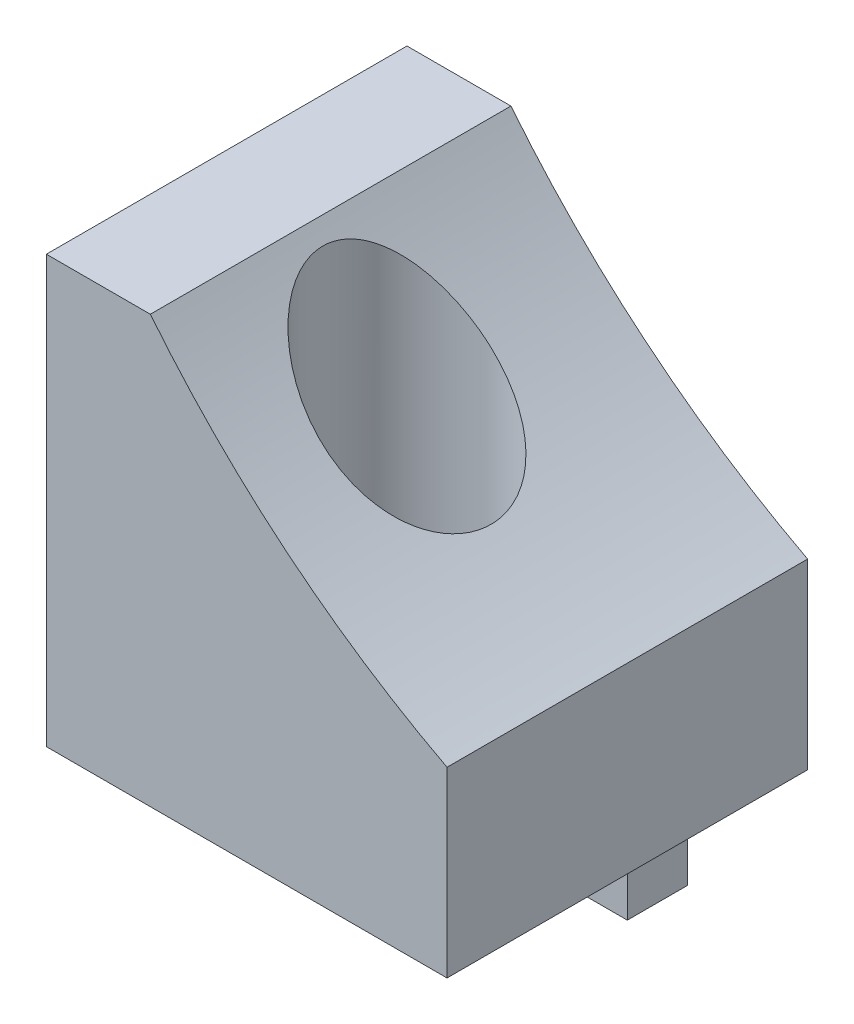
ISO-10303-21;
HEADER;
FILE_DESCRIPTION(('STEP AP214'),'2;1');
FILE_NAME('part.step','',(''),(''),'','','');
FILE_SCHEMA(('AUTOMOTIVE_DESIGN { 1 0 10303 214 1 1 1 1 }'));
ENDSEC;
DATA;
#1=APPLICATION_CONTEXT('core data for automotive mechanical design processes');
#2=APPLICATION_PROTOCOL_DEFINITION('international standard','automotive_design',2000,#1);
#3=PRODUCT_CONTEXT('',#1,'mechanical');
#4=PRODUCT('Part','Part','',(#3));
#5=PRODUCT_RELATED_PRODUCT_CATEGORY('part','',(#4));
#6=PRODUCT_DEFINITION_FORMATION('','',#4);
#7=PRODUCT_DEFINITION_CONTEXT('part definition',#1,'design');
#8=PRODUCT_DEFINITION('design','',#6,#7);
#9=PRODUCT_DEFINITION_SHAPE('','',#8);
#10=(LENGTH_UNIT() NAMED_UNIT(*) SI_UNIT(.MILLI.,.METRE.));
#11=(NAMED_UNIT(*) PLANE_ANGLE_UNIT() SI_UNIT($,.RADIAN.));
#12=(NAMED_UNIT(*) SI_UNIT($,.STERADIAN.) SOLID_ANGLE_UNIT());
#13=UNCERTAINTY_MEASURE_WITH_UNIT(LENGTH_MEASURE(1.E-05),#10,'distance_accuracy_value','');
#14=(GEOMETRIC_REPRESENTATION_CONTEXT(3) GLOBAL_UNCERTAINTY_ASSIGNED_CONTEXT((#13)) GLOBAL_UNIT_ASSIGNED_CONTEXT((#10,
#11,#12)) REPRESENTATION_CONTEXT('',''));
#15=CARTESIAN_POINT('',(0.,0.,0.));
#16=DIRECTION('',(0.,0.,1.));
#17=DIRECTION('',(1.,0.,0.));
#18=AXIS2_PLACEMENT_3D('',#15,#16,#17);
#19=CARTESIAN_POINT('',(0.,0.,18.));
#20=DIRECTION('',(0.,1.,0.));
#21=DIRECTION('',(0.,0.,1.));
#22=AXIS2_PLACEMENT_3D('',#19,#20,#21);
#23=PLANE('',#22);
#24=CARTESIAN_POINT('',(10.,0.,10.));
#25=DIRECTION('',(0.,-1.,0.));
#26=DIRECTION('',(0.,0.,-1.));
#27=AXIS2_PLACEMENT_3D('',#24,#25,#26);
#28=CIRCLE('',#27,4.2);
#29=CARTESIAN_POINT('',(10.,0.,5.8));
#30=VERTEX_POINT('',#29);
#31=EDGE_CURVE('E134',#30,#30,#28,.T.);
#32=ORIENTED_EDGE('',*,*,#31,.F.);
#33=EDGE_LOOP('',(#32));
#34=FACE_BOUND('',#33,.T.);
#35=DIRECTION('',(-1.,0.,0.));
#36=VECTOR('',#35,1.);
#37=CARTESIAN_POINT('',(6.,0.,3.));
#38=LINE('',#37,#36);
#39=CARTESIAN_POINT('',(19.,0.,3.));
#40=VERTEX_POINT('',#39);
#41=CARTESIAN_POINT('',(1.00000000000002,0.,3.));
#42=VERTEX_POINT('',#41);
#43=EDGE_CURVE('E49',#40,#42,#38,.T.);
#44=ORIENTED_EDGE('',*,*,#43,.F.);
#45=DIRECTION('',(0.,0.,-1.));
#46=VECTOR('',#45,1.);
#47=CARTESIAN_POINT('',(19.,0.,0.));
#48=LINE('',#47,#46);
#49=CARTESIAN_POINT('',(19.,0.,0.));
#50=VERTEX_POINT('',#49);
#51=EDGE_CURVE('E54',#40,#50,#48,.T.);
#52=ORIENTED_EDGE('',*,*,#51,.T.);
#53=DIRECTION('',(1.,0.,0.));
#54=VECTOR('',#53,1.);
#55=CARTESIAN_POINT('',(0.,0.,0.));
#56=LINE('',#55,#54);
#57=CARTESIAN_POINT('',(20.,0.,0.));
#58=VERTEX_POINT('',#57);
#59=EDGE_CURVE('E172',#50,#58,#56,.T.);
#60=ORIENTED_EDGE('',*,*,#59,.T.);
#61=DIRECTION('',(0.,0.,-1.));
#62=VECTOR('',#61,1.);
#63=CARTESIAN_POINT('',(20.,0.,18.));
#64=LINE('',#63,#62);
#65=CARTESIAN_POINT('',(20.,0.,18.));
#66=VERTEX_POINT('',#65);
#67=EDGE_CURVE('E370',#66,#58,#64,.T.);
#68=ORIENTED_EDGE('',*,*,#67,.F.);
#69=DIRECTION('',(1.,0.,0.));
#70=VECTOR('',#69,1.);
#71=CARTESIAN_POINT('',(0.,0.,18.));
#72=LINE('',#71,#70);
#73=CARTESIAN_POINT('',(0.,0.,18.));
#74=VERTEX_POINT('',#73);
#75=EDGE_CURVE('E159',#74,#66,#72,.T.);
#76=ORIENTED_EDGE('',*,*,#75,.F.);
#77=DIRECTION('',(0.,0.,-1.));
#78=VECTOR('',#77,1.);
#79=CARTESIAN_POINT('',(0.,0.,18.));
#80=LINE('',#79,#78);
#81=CARTESIAN_POINT('',(0.,0.,0.));
#82=VERTEX_POINT('',#81);
#83=EDGE_CURVE('E200',#74,#82,#80,.T.);
#84=ORIENTED_EDGE('',*,*,#83,.T.);
#85=CARTESIAN_POINT('',(1.00000000000002,0.,0.));
#86=VERTEX_POINT('',#85);
#87=EDGE_CURVE('E182',#82,#86,#56,.T.);
#88=ORIENTED_EDGE('',*,*,#87,.T.);
#89=DIRECTION('',(0.,0.,1.));
#90=VECTOR('',#89,1.);
#91=CARTESIAN_POINT('',(1.00000000000002,0.,3.));
#92=LINE('',#91,#90);
#93=EDGE_CURVE('E199',#86,#42,#92,.T.);
#94=ORIENTED_EDGE('',*,*,#93,.T.);
#95=EDGE_LOOP('',(#44,#52,#60,#68,#76,#84,#88,#94));
#96=FACE_BOUND('',#95,.T.);
#97=ADVANCED_FACE('F34',(#34,#96),#23,.F.);
#98=CARTESIAN_POINT('',(0.,0.,18.));
#99=DIRECTION('',(1.,0.,0.));
#100=DIRECTION('',(0.,0.,-1.));
#101=AXIS2_PLACEMENT_3D('',#98,#99,#100);
#102=PLANE('',#101);
#103=DIRECTION('',(0.,-1.,0.));
#104=VECTOR('',#103,1.);
#105=CARTESIAN_POINT('',(0.,0.,0.));
#106=LINE('',#105,#104);
#107=CARTESIAN_POINT('',(0.,21.29,0.));
#108=VERTEX_POINT('',#107);
#109=EDGE_CURVE('E169',#108,#82,#106,.T.);
#110=ORIENTED_EDGE('',*,*,#109,.T.);
#111=ORIENTED_EDGE('',*,*,#83,.F.);
#112=DIRECTION('',(0.,-1.,0.));
#113=VECTOR('',#112,1.);
#114=CARTESIAN_POINT('',(0.,0.,18.));
#115=LINE('',#114,#113);
#116=CARTESIAN_POINT('',(0.,21.29,18.));
#117=VERTEX_POINT('',#116);
#118=EDGE_CURVE('E156',#117,#74,#115,.T.);
#119=ORIENTED_EDGE('',*,*,#118,.F.);
#120=DIRECTION('',(0.,0.,-1.));
#121=VECTOR('',#120,1.);
#122=CARTESIAN_POINT('',(0.,21.29,18.));
#123=LINE('',#122,#121);
#124=EDGE_CURVE('E168',#117,#108,#123,.T.);
#125=ORIENTED_EDGE('',*,*,#124,.T.);
#126=EDGE_LOOP('',(#110,#111,#119,#125));
#127=FACE_BOUND('',#126,.T.);
#128=ADVANCED_FACE('F217',(#127),#102,.F.);
#129=CARTESIAN_POINT('',(20.,0.,18.));
#130=DIRECTION('',(-1.,0.,0.));
#131=DIRECTION('',(0.,0.,1.));
#132=AXIS2_PLACEMENT_3D('',#129,#130,#131);
#133=PLANE('',#132);
#134=DIRECTION('',(0.,1.,0.));
#135=VECTOR('',#134,1.);
#136=CARTESIAN_POINT('',(20.,0.,0.));
#137=LINE('',#136,#135);
#138=CARTESIAN_POINT('',(20.,9.11131998249283,0.));
#139=VERTEX_POINT('',#138);
#140=EDGE_CURVE('E175',#58,#139,#137,.T.);
#141=ORIENTED_EDGE('',*,*,#140,.T.);
#142=DIRECTION('',(0.,0.,-1.));
#143=VECTOR('',#142,1.);
#144=CARTESIAN_POINT('',(20.,9.11131998249283,18.));
#145=LINE('',#144,#143);
#146=CARTESIAN_POINT('',(20.,9.11131998249283,18.));
#147=VERTEX_POINT('',#146);
#148=EDGE_CURVE('E383',#147,#139,#145,.T.);
#149=ORIENTED_EDGE('',*,*,#148,.F.);
#150=DIRECTION('',(0.,1.,0.));
#151=VECTOR('',#150,1.);
#152=CARTESIAN_POINT('',(20.,0.,18.));
#153=LINE('',#152,#151);
#154=EDGE_CURVE('E162',#66,#147,#153,.T.);
#155=ORIENTED_EDGE('',*,*,#154,.F.);
#156=ORIENTED_EDGE('',*,*,#67,.T.);
#157=EDGE_LOOP('',(#141,#149,#155,#156));
#158=FACE_BOUND('',#157,.T.);
#159=ADVANCED_FACE('F223',(#158),#133,.F.);
#160=CARTESIAN_POINT('',(41.82,50.74,18.));
#161=DIRECTION('',(0.,0.,-1.));
#162=DIRECTION('',(-1.,0.,0.));
#163=AXIS2_PLACEMENT_3D('',#160,#161,#162);
#164=CYLINDRICAL_SURFACE('',#163,47.0006319106456);
#165=CARTESIAN_POINT('',(10.,16.1488595157662,5.8));
#166=CARTESIAN_POINT('',(10.2610919827738,15.9086894406283,5.79999660168163));
#167=CARTESIAN_POINT('',(10.5251766661673,15.6712526478668,5.82430504663748));
#168=CARTESIAN_POINT('',(11.0533833822705,15.2069395064922,5.92535264365591));
#169=CARTESIAN_POINT('',(11.317505131178,14.9800751701141,6.00214995249782));
#170=CARTESIAN_POINT('',(11.797016888444,14.5770021626272,6.19646315380798));
#171=CARTESIAN_POINT('',(12.0136346772341,14.398380502343,6.30586148109498));
#172=CARTESIAN_POINT('',(12.4334693690987,14.058070765696,6.5679006657079));
#173=CARTESIAN_POINT('',(12.6367073751545,13.896355774591,6.72047131334826));
#174=CARTESIAN_POINT('',(12.9838822608656,13.6242788472283,7.0368146737019));
#175=CARTESIAN_POINT('',(13.1317256320048,13.5100112452384,7.19286032882953));
#176=CARTESIAN_POINT('',(13.3376811306643,13.3525095038854,7.44816128368588));
#177=CARTESIAN_POINT('',(13.4037268951472,13.3023040650949,7.536849660434));
#178=CARTESIAN_POINT('',(13.5296980043657,13.2070220657892,7.72103908226867));
#179=CARTESIAN_POINT('',(13.5896261259045,13.1619431772593,7.81653700276325));
#180=CARTESIAN_POINT('',(13.7030233883191,13.0770195238952,8.01485841134376));
#181=CARTESIAN_POINT('',(13.7564277798413,13.0372269324842,8.11774139890103));
#182=CARTESIAN_POINT('',(13.855206504869,12.9639029429748,8.3293691398118));
#183=CARTESIAN_POINT('',(13.900585143778,12.930368187334,8.43811070923967));
#184=CARTESIAN_POINT('',(13.9824765259776,12.8700346412125,8.66062427091615));
#185=CARTESIAN_POINT('',(14.0189940546469,12.8432322147098,8.77439350858854));
#186=CARTESIAN_POINT('',(14.0824435703745,12.7967671963842,9.00598751263774));
#187=CARTESIAN_POINT('',(14.1093774092053,12.7771032252453,9.12381149072201));
#188=CARTESIAN_POINT('',(14.1498751661082,12.7475781211538,9.34482959182993));
#189=CARTESIAN_POINT('',(14.1648197467832,12.7367028833451,9.4476381120262));
#190=CARTESIAN_POINT('',(14.1870580326465,12.720529860189,9.65451025303373));
#191=CARTESIAN_POINT('',(14.1943526013253,12.7152314453608,9.75857373085087));
#192=CARTESIAN_POINT('',(14.2011649048693,12.7102831248388,9.96704368134505));
#193=CARTESIAN_POINT('',(14.2006859513544,12.7106308138328,10.0714499890206));
#194=CARTESIAN_POINT('',(14.1919685232786,12.7169634884924,10.2797634352825));
#195=CARTESIAN_POINT('',(14.1837302869887,12.7229483010539,10.3836705890983));
#196=CARTESIAN_POINT('',(14.160596034264,12.7397768590913,10.5818796943664));
#197=CARTESIAN_POINT('',(14.1462837450953,12.750194768432,10.6762864779435));
#198=CARTESIAN_POINT('',(14.1114158748061,12.7756190098332,10.8633228874688));
#199=CARTESIAN_POINT('',(14.0908582045238,12.7906268773061,10.9559519076913));
#200=CARTESIAN_POINT('',(14.020219317583,12.84230810461,11.2301917928868));
#201=CARTESIAN_POINT('',(13.961149358064,12.8856555608064,11.4083457095176));
#202=CARTESIAN_POINT('',(13.8194638403595,12.9903332294536,11.7574258823765));
#203=CARTESIAN_POINT('',(13.73606214464,13.05226623819,11.9278452636117));
#204=CARTESIAN_POINT('',(13.5505068207882,13.1912505195793,12.2513786750597));
#205=CARTESIAN_POINT('',(13.4483466978234,13.2683070291628,12.4044866817024));
#206=CARTESIAN_POINT('',(13.2151451334036,13.4459561613123,12.7100421316888));
#207=CARTESIAN_POINT('',(13.0820825323736,13.5482963474247,12.8599229134059));
#208=CARTESIAN_POINT('',(12.8020719242747,13.7663484939976,13.1348019721772));
#209=CARTESIAN_POINT('',(12.6551139664205,13.8820700505919,13.2597822153068));
#210=CARTESIAN_POINT('',(12.2796658463968,14.1817005467631,13.5384443958669));
#211=CARTESIAN_POINT('',(12.0454728135797,14.3719839822218,13.6777668495096));
#212=CARTESIAN_POINT('',(11.6867842276376,14.6696064427105,13.8486906010441));
#213=CARTESIAN_POINT('',(11.565822867172,14.7709893771484,13.8993636872396));
#214=CARTESIAN_POINT('',(11.3223030387342,14.9772366726889,13.9885212477006));
#215=CARTESIAN_POINT('',(11.1997444263418,15.082101349949,14.0270046117236));
#216=CARTESIAN_POINT('',(10.9229849268337,15.3214279068421,14.1004213845412));
#217=CARTESIAN_POINT('',(10.7685921141048,15.456689753508,14.1320171450345));
#218=CARTESIAN_POINT('',(10.4601506628917,15.7305469500407,14.1776273232692));
#219=CARTESIAN_POINT('',(10.3061021108221,15.8691430522599,14.1916377343429));
#220=CARTESIAN_POINT('',(9.99942439525354,16.1487660831752,14.2028040929992));
#221=CARTESIAN_POINT('',(9.84679635254487,16.2897947159639,14.1999477032507));
#222=CARTESIAN_POINT('',(9.54407300400734,16.573248111915,14.1779374630227));
#223=CARTESIAN_POINT('',(9.39397749103069,16.7156727593693,14.1587849521367));
#224=CARTESIAN_POINT('',(9.09561590172941,17.0025229289473,14.1043061417992));
#225=CARTESIAN_POINT('',(8.94738558617829,17.1469537572106,14.0688121175498));
#226=CARTESIAN_POINT('',(8.65521123987655,17.4353707821119,13.9818063694153));
#227=CARTESIAN_POINT('',(8.51126775703422,17.5793569198233,13.9302926075627));
#228=CARTESIAN_POINT('',(8.22864465296834,17.8656835475881,13.8112724094561));
#229=CARTESIAN_POINT('',(8.08996153483666,18.0080250855367,13.7437768214678));
#230=CARTESIAN_POINT('',(7.81874308519524,18.289851397588,13.5925234800973));
#231=CARTESIAN_POINT('',(7.68620567747541,18.4293371274452,13.5087712690267));
#232=CARTESIAN_POINT('',(7.46484436969556,18.6650731549733,13.3505069307933));
#233=CARTESIAN_POINT('',(7.37425164974593,18.7624022824602,13.2800720117421));
#234=CARTESIAN_POINT('',(7.19734687589825,18.9540225526517,13.1302678728727));
#235=CARTESIAN_POINT('',(7.11103580914534,19.0483129930405,13.0508966064232));
#236=CARTESIAN_POINT('',(6.85970088384712,19.3250605888088,12.7990617034235));
#237=CARTESIAN_POINT('',(6.70182691889585,19.5018734121979,12.6125639464232));
#238=CARTESIAN_POINT('',(6.45567390303711,19.7811910039447,12.2603909862085));
#239=CARTESIAN_POINT('',(6.36057235524858,19.8902690331812,12.1046850221195));
#240=CARTESIAN_POINT('',(6.18792269996806,20.0898486502119,11.7728237695468));
#241=CARTESIAN_POINT('',(6.11034802361487,20.1803783356346,11.5967000538929));
#242=CARTESIAN_POINT('',(5.9918667026221,20.3194339208108,11.2645429696793));
#243=CARTESIAN_POINT('',(5.94667884120009,20.3727901753541,11.1120839869725));
#244=CARTESIAN_POINT('',(5.87329589258817,20.4596907429972,10.7976769351828));
#245=CARTESIAN_POINT('',(5.84508513800652,20.493253322196,10.6357377668679));
#246=CARTESIAN_POINT('',(5.80781567054544,20.537634602919,10.3055037885928));
#247=CARTESIAN_POINT('',(5.79887335022887,20.5483150810252,10.1371765694817));
#248=CARTESIAN_POINT('',(5.80135497239107,20.5453545397332,9.80088984832869));
#249=CARTESIAN_POINT('',(5.81277802073134,20.53171458812,9.63293033046714));
#250=CARTESIAN_POINT('',(5.8529746411114,20.4838715658333,9.31800622358354));
#251=CARTESIAN_POINT('',(5.88008896365085,20.4516357983739,9.17051503829388));
#252=CARTESIAN_POINT('',(5.94840822367702,20.3707540955767,8.88358110702211));
#253=CARTESIAN_POINT('',(5.98961947377266,20.3221008086003,8.7441419995156));
#254=CARTESIAN_POINT('',(6.10500420858491,20.1866131503494,8.41525231284448));
#255=CARTESIAN_POINT('',(6.18568656654111,20.0924206448308,8.23112830117666));
#256=CARTESIAN_POINT('',(6.36615396545136,19.8838300108236,7.88494053174191));
#257=CARTESIAN_POINT('',(6.46598291917778,19.7693854818584,7.72292898004669));
#258=CARTESIAN_POINT('',(6.65114903007861,19.5594718020685,7.46161085676382));
#259=CARTESIAN_POINT('',(6.7331019062708,19.4672435315856,7.35719688910033));
#260=CARTESIAN_POINT('',(6.90353655994918,19.2770650801798,7.15940726546121));
#261=CARTESIAN_POINT('',(6.99202123664224,19.1791123624694,7.06603655958172));
#262=CARTESIAN_POINT('',(7.17465895208708,18.9787316848021,6.88976125699422));
#263=CARTESIAN_POINT('',(7.26882236559883,18.8762956337494,6.80687672939608));
#264=CARTESIAN_POINT('',(7.46188836600027,18.6682099009444,6.65136581511626));
#265=CARTESIAN_POINT('',(7.56079070840601,18.5625603850791,6.57873890000017));
#266=CARTESIAN_POINT('',(7.7966994129393,18.3129593714899,6.42063417922251));
#267=CARTESIAN_POINT('',(7.93533570325577,18.168074281506,6.3390470696508));
#268=CARTESIAN_POINT('',(8.21883596336958,17.8756928334057,6.19304797423478));
#269=CARTESIAN_POINT('',(8.36370259711051,17.7281953744806,6.12864342174225));
#270=CARTESIAN_POINT('',(8.65831306529821,17.4322617820111,6.01695593909806));
#271=CARTESIAN_POINT('',(8.80804623962761,17.2838282075844,5.96963801686055));
#272=CARTESIAN_POINT('',(9.11167491891969,16.9869272718171,5.89203046156109));
#273=CARTESIAN_POINT('',(9.26556792960632,16.8384599814261,5.86173085156642));
#274=CARTESIAN_POINT('',(9.51649297525005,16.5996984416,5.82681237547648));
#275=CARTESIAN_POINT('',(9.61251091059028,16.5091004964862,5.8167940536907));
#276=CARTESIAN_POINT('',(9.80554693643162,16.3284946352164,5.80338832695016));
#277=CARTESIAN_POINT('',(9.90256507888455,16.23848675011,5.80000126819246));
#278=CARTESIAN_POINT('',(10.,16.1488595157662,5.8));
#279=B_SPLINE_CURVE_WITH_KNOTS('',3,(#165,#166,#167,#168,#169,#170,#171,#172,#173,#174,#175,
#176,#177,#178,#179,#180,#181,#182,#183,#184,#185,#186,#187,#188,#189,#190,#191,#192,#193,#194,
#195,#196,#197,#198,#199,#200,#201,#202,#203,#204,#205,#206,#207,#208,#209,#210,#211,#212,#213,
#214,#215,#216,#217,#218,#219,#220,#221,#222,#223,#224,#225,#226,#227,#228,#229,#230,#231,#232,
#233,#234,#235,#236,#237,#238,#239,#240,#241,#242,#243,#244,#245,#246,#247,#248,#249,#250,#251,
#252,#253,#254,#255,#256,#257,#258,#259,#260,#261,#262,#263,#264,#265,#266,#267,#268,#269,#270,
#271,#272,#273,#274,#275,#276,#277,#278),.UNSPECIFIED.,.T.,.F.,(4,2,2,2,2,2,2,2,2,2,2,2,2,2,2,2,
2,2,2,2,2,2,2,2,2,2,2,2,2,2,2,2,2,2,2,2,2,2,2,2,2,2,2,2,2,2,2,2,2,2,2,2,2,2,2,2,4),(0.,
1.06391180307652,2.12900431760187,3.02964956997653,3.92883846922963,4.65600381618565,
5.01994805052789,5.38372634880548,5.75086364364609,6.11780338685504,6.48454452365429,
6.85121475974336,7.16416579863785,7.47708150956287,7.7898639178961,8.10263672166242,
8.39045123676593,8.67836213580442,9.25361398015461,9.85002473751626,10.446642384144,
11.1192307091921,11.7923043918026,12.7835439770249,13.2804834056417,13.7774680826022,
14.399675830408,15.0220253170759,15.6448300816816,16.267583654685,16.8968765975414,
17.5262496293217,18.1551966690169,18.7839296595032,19.2349864517375,19.6861467574101,
20.586303713191,21.2221090788357,21.8569440665694,22.3581542983579,22.8589012741007,
23.362664670899,23.8664059505842,24.324676190554,24.7831519133237,25.4454588556864,
26.1093033690868,26.5935812604321,27.0780754111684,27.5634832242166,28.0488660217142,
28.6974630190453,29.3463401528207,29.9938807979104,30.6410414270129,31.038053813459,
31.4350869261011),.UNSPECIFIED.);
#280=CARTESIAN_POINT('',(10.,16.1488595157662,5.8));
#281=VERTEX_POINT('',#280);
#282=EDGE_CURVE('E155',#281,#281,#279,.T.);
#283=ORIENTED_EDGE('',*,*,#282,.T.);
#284=EDGE_LOOP('',(#283));
#285=FACE_BOUND('',#284,.T.);
#286=CARTESIAN_POINT('',(41.82,50.74,0.));
#287=DIRECTION('',(0.,0.,-1.));
#288=DIRECTION('',(1.,0.,0.));
#289=AXIS2_PLACEMENT_3D('',#286,#287,#288);
#290=CIRCLE('',#289,47.0006319106456);
#291=CARTESIAN_POINT('',(5.18999999999999,21.29,0.));
#292=VERTEX_POINT('',#291);
#293=EDGE_CURVE('E376',#139,#292,#290,.T.);
#294=ORIENTED_EDGE('',*,*,#293,.T.);
#295=DIRECTION('',(0.,0.,-1.));
#296=VECTOR('',#295,1.);
#297=CARTESIAN_POINT('',(5.18999999999999,21.29,18.));
#298=LINE('',#297,#296);
#299=CARTESIAN_POINT('',(5.18999999999999,21.29,18.));
#300=VERTEX_POINT('',#299);
#301=EDGE_CURVE('E381',#300,#292,#298,.T.);
#302=ORIENTED_EDGE('',*,*,#301,.F.);
#303=CARTESIAN_POINT('',(41.82,50.74,18.));
#304=DIRECTION('',(0.,0.,-1.));
#305=DIRECTION('',(1.,0.,0.));
#306=AXIS2_PLACEMENT_3D('',#303,#304,#305);
#307=CIRCLE('',#306,47.0006319106456);
#308=EDGE_CURVE('E164',#147,#300,#307,.T.);
#309=ORIENTED_EDGE('',*,*,#308,.F.);
#310=ORIENTED_EDGE('',*,*,#148,.T.);
#311=EDGE_LOOP('',(#294,#302,#309,#310));
#312=FACE_BOUND('',#311,.T.);
#313=ADVANCED_FACE('F229',(#285,#312),#164,.F.);
#314=CARTESIAN_POINT('',(0.,21.29,18.));
#315=DIRECTION('',(0.,-1.,0.));
#316=DIRECTION('',(0.,0.,-1.));
#317=AXIS2_PLACEMENT_3D('',#314,#315,#316);
#318=PLANE('',#317);
#319=DIRECTION('',(-1.,0.,0.));
#320=VECTOR('',#319,1.);
#321=CARTESIAN_POINT('',(0.,21.29,0.));
#322=LINE('',#321,#320);
#323=EDGE_CURVE('E160',#292,#108,#322,.T.);
#324=ORIENTED_EDGE('',*,*,#323,.T.);
#325=ORIENTED_EDGE('',*,*,#124,.F.);
#326=DIRECTION('',(-1.,0.,0.));
#327=VECTOR('',#326,1.);
#328=CARTESIAN_POINT('',(0.,21.29,18.));
#329=LINE('',#328,#327);
#330=EDGE_CURVE('E166',#300,#117,#329,.T.);
#331=ORIENTED_EDGE('',*,*,#330,.F.);
#332=ORIENTED_EDGE('',*,*,#301,.T.);
#333=EDGE_LOOP('',(#324,#325,#331,#332));
#334=FACE_BOUND('',#333,.T.);
#335=ADVANCED_FACE('F234',(#334),#318,.F.);
#336=CARTESIAN_POINT('',(41.82,50.74,18.));
#337=DIRECTION('',(0.,0.,1.));
#338=DIRECTION('',(1.,0.,0.));
#339=AXIS2_PLACEMENT_3D('',#336,#337,#338);
#340=PLANE('',#339);
#341=ORIENTED_EDGE('',*,*,#118,.T.);
#342=ORIENTED_EDGE('',*,*,#75,.T.);
#343=ORIENTED_EDGE('',*,*,#154,.T.);
#344=ORIENTED_EDGE('',*,*,#308,.T.);
#345=ORIENTED_EDGE('',*,*,#330,.T.);
#346=EDGE_LOOP('',(#341,#342,#343,#344,#345));
#347=FACE_BOUND('',#346,.T.);
#348=ADVANCED_FACE('F238',(#347),#340,.T.);
#349=CARTESIAN_POINT('',(41.82,50.74,0.));
#350=DIRECTION('',(0.,0.,1.));
#351=DIRECTION('',(1.,0.,0.));
#352=AXIS2_PLACEMENT_3D('',#349,#350,#351);
#353=PLANE('',#352);
#354=CARTESIAN_POINT('',(10.,-3.,0.));
#355=DIRECTION('',(0.,0.,1.));
#356=DIRECTION('',(1.,0.,0.));
#357=AXIS2_PLACEMENT_3D('',#354,#355,#356);
#358=CIRCLE('',#357,1.6);
#359=CARTESIAN_POINT('',(11.6,-3.,0.));
#360=VERTEX_POINT('',#359);
#361=EDGE_CURVE('E148',#360,#360,#358,.T.);
#362=ORIENTED_EDGE('',*,*,#361,.T.);
#363=EDGE_LOOP('',(#362));
#364=FACE_BOUND('',#363,.T.);
#365=ORIENTED_EDGE('',*,*,#109,.F.);
#366=ORIENTED_EDGE('',*,*,#323,.F.);
#367=ORIENTED_EDGE('',*,*,#293,.F.);
#368=ORIENTED_EDGE('',*,*,#140,.F.);
#369=ORIENTED_EDGE('',*,*,#59,.F.);
#370=DIRECTION('',(0.707106781186544,0.707106781186551,0.));
#371=VECTOR('',#370,1.);
#372=CARTESIAN_POINT('',(55.7799999999999,36.7800000000003,0.));
#373=LINE('',#372,#371);
#374=CARTESIAN_POINT('',(14.,-5.00000000000004,0.));
#375=VERTEX_POINT('',#374);
#376=EDGE_CURVE('E11',#50,#375,#373,.F.);
#377=ORIENTED_EDGE('',*,*,#376,.T.);
#378=DIRECTION('',(0.,1.,0.));
#379=VECTOR('',#378,1.);
#380=CARTESIAN_POINT('',(14.,-8.,0.));
#381=LINE('',#380,#379);
#382=CARTESIAN_POINT('',(14.,-8.,0.));
#383=VERTEX_POINT('',#382);
#384=EDGE_CURVE('E127',#383,#375,#381,.T.);
#385=ORIENTED_EDGE('',*,*,#384,.F.);
#386=DIRECTION('',(1.,0.,0.));
#387=VECTOR('',#386,1.);
#388=CARTESIAN_POINT('',(10.,-8.,0.));
#389=LINE('',#388,#387);
#390=CARTESIAN_POINT('',(6.,-8.,0.));
#391=VERTEX_POINT('',#390);
#392=EDGE_CURVE('E114',#391,#383,#389,.T.);
#393=ORIENTED_EDGE('',*,*,#392,.F.);
#394=DIRECTION('',(0.,1.,0.));
#395=VECTOR('',#394,1.);
#396=CARTESIAN_POINT('',(6.,-8.,0.));
#397=LINE('',#396,#395);
#398=CARTESIAN_POINT('',(6.,-5.00000000000004,0.));
#399=VERTEX_POINT('',#398);
#400=EDGE_CURVE('E146',#391,#399,#397,.T.);
#401=ORIENTED_EDGE('',*,*,#400,.T.);
#402=DIRECTION('',(0.707106781186544,-0.707106781186551,0.));
#403=VECTOR('',#402,1.);
#404=CARTESIAN_POINT('',(-3.96000000000022,4.9600000000003,0.));
#405=LINE('',#404,#403);
#406=EDGE_CURVE('E202',#399,#86,#405,.F.);
#407=ORIENTED_EDGE('',*,*,#406,.T.);
#408=ORIENTED_EDGE('',*,*,#87,.F.);
#409=EDGE_LOOP('',(#365,#366,#367,#368,#369,#377,#385,#393,#401,#407,#408));
#410=FACE_BOUND('',#409,.T.);
#411=ADVANCED_FACE('F129',(#364,#410),#353,.F.);
#412=CARTESIAN_POINT('',(10.,28.,10.));
#413=DIRECTION('',(0.,-1.,0.));
#414=DIRECTION('',(0.,0.,-1.));
#415=AXIS2_PLACEMENT_3D('',#412,#413,#414);
#416=CYLINDRICAL_SURFACE('',#415,4.2);
#417=ORIENTED_EDGE('',*,*,#31,.T.);
#418=EDGE_LOOP('',(#417));
#419=FACE_BOUND('',#418,.T.);
#420=ORIENTED_EDGE('',*,*,#282,.F.);
#421=EDGE_LOOP('',(#420));
#422=FACE_BOUND('',#421,.T.);
#423=ADVANCED_FACE('F242',(#419,#422),#416,.F.);
#424=CARTESIAN_POINT('',(14.,-8.,3.));
#425=DIRECTION('',(-1.,0.,0.));
#426=DIRECTION('',(0.,0.,1.));
#427=AXIS2_PLACEMENT_3D('',#424,#425,#426);
#428=PLANE('',#427);
#429=ORIENTED_EDGE('',*,*,#384,.T.);
#430=DIRECTION('',(0.,0.,1.));
#431=VECTOR('',#430,1.);
#432=CARTESIAN_POINT('',(14.,-5.00000000000004,3.));
#433=LINE('',#432,#431);
#434=CARTESIAN_POINT('',(14.,-5.00000000000004,3.));
#435=VERTEX_POINT('',#434);
#436=EDGE_CURVE('E205',#375,#435,#433,.T.);
#437=ORIENTED_EDGE('',*,*,#436,.T.);
#438=DIRECTION('',(0.,1.,0.));
#439=VECTOR('',#438,1.);
#440=CARTESIAN_POINT('',(14.,-8.,3.));
#441=LINE('',#440,#439);
#442=CARTESIAN_POINT('',(14.,-8.,3.));
#443=VERTEX_POINT('',#442);
#444=EDGE_CURVE('E135',#443,#435,#441,.T.);
#445=ORIENTED_EDGE('',*,*,#444,.F.);
#446=DIRECTION('',(0.,0.,1.));
#447=VECTOR('',#446,1.);
#448=CARTESIAN_POINT('',(14.,-8.,3.));
#449=LINE('',#448,#447);
#450=EDGE_CURVE('E118',#383,#443,#449,.T.);
#451=ORIENTED_EDGE('',*,*,#450,.F.);
#452=EDGE_LOOP('',(#429,#437,#445,#451));
#453=FACE_BOUND('',#452,.T.);
#454=ADVANCED_FACE('F137',(#453),#428,.F.);
#455=CARTESIAN_POINT('',(6.,-8.,3.));
#456=DIRECTION('',(0.,0.,-1.));
#457=DIRECTION('',(-1.,0.,0.));
#458=AXIS2_PLACEMENT_3D('',#455,#456,#457);
#459=PLANE('',#458);
#460=CARTESIAN_POINT('',(10.,-3.,3.));
#461=DIRECTION('',(0.,0.,1.));
#462=DIRECTION('',(1.,0.,0.));
#463=AXIS2_PLACEMENT_3D('',#460,#461,#462);
#464=CIRCLE('',#463,1.6);
#465=CARTESIAN_POINT('',(11.6,-3.,3.));
#466=VERTEX_POINT('',#465);
#467=EDGE_CURVE('E268',#466,#466,#464,.T.);
#468=ORIENTED_EDGE('',*,*,#467,.F.);
#469=EDGE_LOOP('',(#468));
#470=FACE_BOUND('',#469,.T.);
#471=ORIENTED_EDGE('',*,*,#43,.T.);
#472=DIRECTION('',(-0.707106781186544,0.707106781186551,0.));
#473=VECTOR('',#472,1.);
#474=CARTESIAN_POINT('',(7.49999999999998,-6.50000000000003,3.));
#475=LINE('',#474,#473);
#476=CARTESIAN_POINT('',(6.,-5.00000000000004,3.));
#477=VERTEX_POINT('',#476);
#478=EDGE_CURVE('E204',#42,#477,#475,.F.);
#479=ORIENTED_EDGE('',*,*,#478,.T.);
#480=DIRECTION('',(0.,1.,0.));
#481=VECTOR('',#480,1.);
#482=CARTESIAN_POINT('',(6.,-8.,3.));
#483=LINE('',#482,#481);
#484=CARTESIAN_POINT('',(6.,-8.,3.));
#485=VERTEX_POINT('',#484);
#486=EDGE_CURVE('E149',#485,#477,#483,.T.);
#487=ORIENTED_EDGE('',*,*,#486,.F.);
#488=DIRECTION('',(-1.,0.,0.));
#489=VECTOR('',#488,1.);
#490=CARTESIAN_POINT('',(6.,-8.,3.));
#491=LINE('',#490,#489);
#492=EDGE_CURVE('E140',#443,#485,#491,.T.);
#493=ORIENTED_EDGE('',*,*,#492,.F.);
#494=ORIENTED_EDGE('',*,*,#444,.T.);
#495=DIRECTION('',(-0.707106781186544,-0.707106781186551,0.));
#496=VECTOR('',#495,1.);
#497=CARTESIAN_POINT('',(8.50000000000006,-10.5,3.));
#498=LINE('',#497,#496);
#499=EDGE_CURVE('E42',#435,#40,#498,.F.);
#500=ORIENTED_EDGE('',*,*,#499,.T.);
#501=EDGE_LOOP('',(#471,#479,#487,#493,#494,#500));
#502=FACE_BOUND('',#501,.T.);
#503=ADVANCED_FACE('F207',(#470,#502),#459,.F.);
#504=CARTESIAN_POINT('',(6.,-8.,0.));
#505=DIRECTION('',(1.,0.,0.));
#506=DIRECTION('',(0.,0.,-1.));
#507=AXIS2_PLACEMENT_3D('',#504,#505,#506);
#508=PLANE('',#507);
#509=ORIENTED_EDGE('',*,*,#486,.T.);
#510=DIRECTION('',(0.,0.,-1.));
#511=VECTOR('',#510,1.);
#512=CARTESIAN_POINT('',(6.,-5.00000000000004,0.));
#513=LINE('',#512,#511);
#514=EDGE_CURVE('E196',#477,#399,#513,.T.);
#515=ORIENTED_EDGE('',*,*,#514,.T.);
#516=ORIENTED_EDGE('',*,*,#400,.F.);
#517=DIRECTION('',(0.,0.,-1.));
#518=VECTOR('',#517,1.);
#519=CARTESIAN_POINT('',(6.,-8.,0.));
#520=LINE('',#519,#518);
#521=EDGE_CURVE('E121',#485,#391,#520,.T.);
#522=ORIENTED_EDGE('',*,*,#521,.F.);
#523=EDGE_LOOP('',(#509,#515,#516,#522));
#524=FACE_BOUND('',#523,.T.);
#525=ADVANCED_FACE('F254',(#524),#508,.F.);
#526=CARTESIAN_POINT('',(0.,-8.,0.));
#527=DIRECTION('',(0.,1.,0.));
#528=DIRECTION('',(0.,0.,1.));
#529=AXIS2_PLACEMENT_3D('',#526,#527,#528);
#530=PLANE('',#529);
#531=ORIENTED_EDGE('',*,*,#392,.T.);
#532=ORIENTED_EDGE('',*,*,#450,.T.);
#533=ORIENTED_EDGE('',*,*,#492,.T.);
#534=ORIENTED_EDGE('',*,*,#521,.T.);
#535=EDGE_LOOP('',(#531,#532,#533,#534));
#536=FACE_BOUND('',#535,.T.);
#537=ADVANCED_FACE('F116',(#536),#530,.F.);
#538=CARTESIAN_POINT('',(10.,-3.,-5.));
#539=DIRECTION('',(0.,0.,1.));
#540=DIRECTION('',(1.,0.,0.));
#541=AXIS2_PLACEMENT_3D('',#538,#539,#540);
#542=CYLINDRICAL_SURFACE('',#541,1.6);
#543=ORIENTED_EDGE('',*,*,#467,.T.);
#544=EDGE_LOOP('',(#543));
#545=FACE_BOUND('',#544,.T.);
#546=ORIENTED_EDGE('',*,*,#361,.F.);
#547=EDGE_LOOP('',(#546));
#548=FACE_BOUND('',#547,.T.);
#549=ADVANCED_FACE('F214',(#545,#548),#542,.F.);
#550=CARTESIAN_POINT('',(6.,-5.00000000000004,0.));
#551=DIRECTION('',(-0.707106781186551,-0.707106781186544,0.));
#552=DIRECTION('',(0.,0.,1.));
#553=AXIS2_PLACEMENT_3D('',#550,#551,#552);
#554=PLANE('',#553);
#555=ORIENTED_EDGE('',*,*,#478,.F.);
#556=ORIENTED_EDGE('',*,*,#93,.F.);
#557=ORIENTED_EDGE('',*,*,#406,.F.);
#558=ORIENTED_EDGE('',*,*,#514,.F.);
#559=EDGE_LOOP('',(#555,#556,#557,#558));
#560=FACE_BOUND('',#559,.T.);
#561=ADVANCED_FACE('F210',(#560),#554,.T.);
#562=CARTESIAN_POINT('',(14.,-5.00000000000004,3.));
#563=DIRECTION('',(0.707106781186551,-0.707106781186544,0.));
#564=DIRECTION('',(0.,0.,-1.));
#565=AXIS2_PLACEMENT_3D('',#562,#563,#564);
#566=PLANE('',#565);
#567=ORIENTED_EDGE('',*,*,#376,.F.);
#568=ORIENTED_EDGE('',*,*,#51,.F.);
#569=ORIENTED_EDGE('',*,*,#499,.F.);
#570=ORIENTED_EDGE('',*,*,#436,.F.);
#571=EDGE_LOOP('',(#567,#568,#569,#570));
#572=FACE_BOUND('',#571,.T.);
#573=ADVANCED_FACE('F36',(#572),#566,.T.);
#574=CLOSED_SHELL('',(#97,#128,#159,#313,#335,#348,#411,#423,#454,#503,#525,#537,#549,#561,#573));
#575=MANIFOLD_SOLID_BREP('B2',#574);
#576=ADVANCED_BREP_SHAPE_REPRESENTATION('',(#18,#575),#14);
#577=SHAPE_DEFINITION_REPRESENTATION(#9,#576);
ENDSEC;
END-ISO-10303-21;
